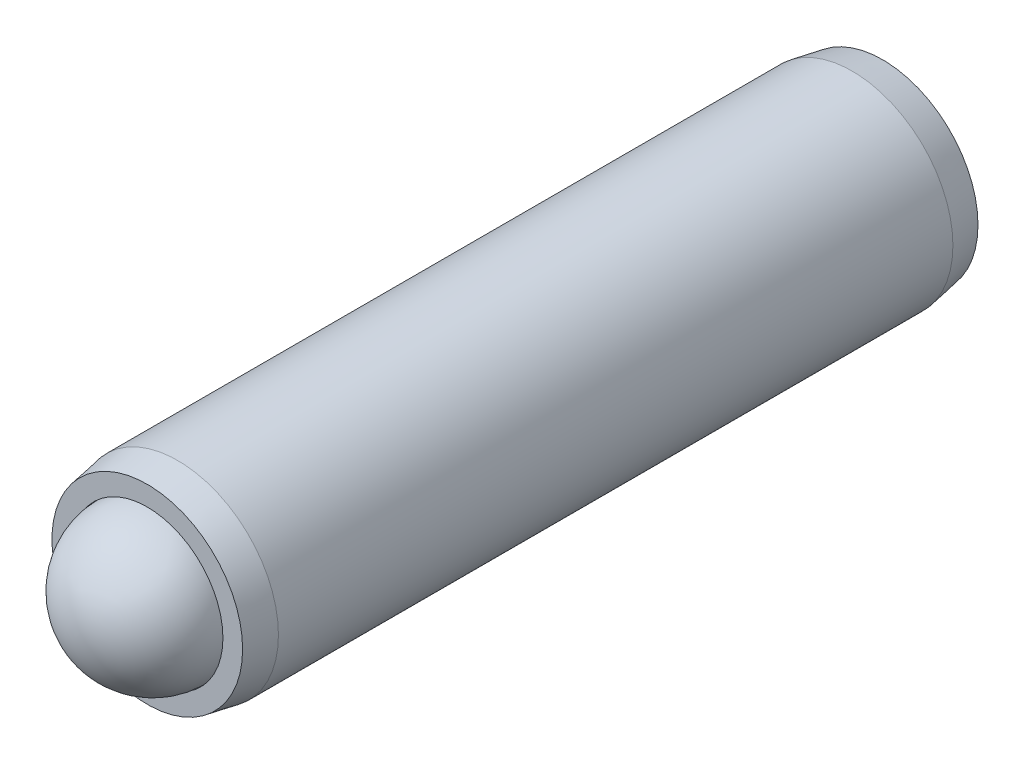
ISO-10303-21;
HEADER;
FILE_DESCRIPTION(('STEP AP214'),'2;1');
FILE_NAME('part.step','',(''),(''),'','','');
FILE_SCHEMA(('AUTOMOTIVE_DESIGN { 1 0 10303 214 1 1 1 1 }'));
ENDSEC;
DATA;
#1=APPLICATION_CONTEXT('core data for automotive mechanical design processes');
#2=APPLICATION_PROTOCOL_DEFINITION('international standard','automotive_design',2000,#1);
#3=PRODUCT_CONTEXT('',#1,'mechanical');
#4=PRODUCT('Part','Part','',(#3));
#5=PRODUCT_RELATED_PRODUCT_CATEGORY('part','',(#4));
#6=PRODUCT_DEFINITION_FORMATION('','',#4);
#7=PRODUCT_DEFINITION_CONTEXT('part definition',#1,'design');
#8=PRODUCT_DEFINITION('design','',#6,#7);
#9=PRODUCT_DEFINITION_SHAPE('','',#8);
#10=(LENGTH_UNIT() NAMED_UNIT(*) SI_UNIT(.MILLI.,.METRE.));
#11=(NAMED_UNIT(*) PLANE_ANGLE_UNIT() SI_UNIT($,.RADIAN.));
#12=(NAMED_UNIT(*) SI_UNIT($,.STERADIAN.) SOLID_ANGLE_UNIT());
#13=UNCERTAINTY_MEASURE_WITH_UNIT(LENGTH_MEASURE(1.E-05),#10,'distance_accuracy_value','');
#14=(GEOMETRIC_REPRESENTATION_CONTEXT(3) GLOBAL_UNCERTAINTY_ASSIGNED_CONTEXT((#13)) GLOBAL_UNIT_ASSIGNED_CONTEXT((#10,
#11,#12)) REPRESENTATION_CONTEXT('',''));
#15=CARTESIAN_POINT('',(0.,0.,0.));
#16=DIRECTION('',(0.,0.,1.));
#17=DIRECTION('',(1.,0.,0.));
#18=AXIS2_PLACEMENT_3D('',#15,#16,#17);
#19=CARTESIAN_POINT('',(27.4924431015506,-4.03232337640702,-29.1589490354947));
#20=DIRECTION('',(0.,0.,1.));
#21=DIRECTION('',(1.,0.,0.));
#22=AXIS2_PLACEMENT_3D('',#19,#20,#21);
#23=CONICAL_SURFACE('',#22,4.5085,0.174532925199426);
#24=CARTESIAN_POINT('',(27.4924431015506,-4.03232337640702,-27.7184434533117));
#25=DIRECTION('',(0.,0.,1.));
#26=DIRECTION('',(1.,0.,0.));
#27=AXIS2_PLACEMENT_3D('',#24,#25,#26);
#28=CIRCLE('',#27,4.7625);
#29=CARTESIAN_POINT('',(32.2549431015506,-4.03232337640702,-27.7184434533117));
#30=VERTEX_POINT('',#29);
#31=EDGE_CURVE('P0_E150',#30,#30,#28,.T.);
#32=ORIENTED_EDGE('',*,*,#31,.F.);
#33=EDGE_LOOP('',(#32));
#34=FACE_BOUND('',#33,.T.);
#35=CARTESIAN_POINT('',(27.4924431015506,-4.03232337640702,-29.1589490354947));
#36=DIRECTION('',(0.,0.,1.));
#37=DIRECTION('',(1.,0.,0.));
#38=AXIS2_PLACEMENT_3D('',#35,#36,#37);
#39=CIRCLE('',#38,4.5085);
#40=CARTESIAN_POINT('',(32.0009431015506,-4.03232337640702,-29.1589490354947));
#41=VERTEX_POINT('',#40);
#42=EDGE_CURVE('P0_E126',#41,#41,#39,.T.);
#43=ORIENTED_EDGE('',*,*,#42,.T.);
#44=EDGE_LOOP('',(#43));
#45=FACE_BOUND('',#44,.T.);
#46=ADVANCED_FACE('P0_F16',(#34,#45),#23,.T.);
#47=CARTESIAN_POINT('',(27.4924431015506,-4.03232337640702,0.317781896403881));
#48=DIRECTION('',(0.,0.,1.));
#49=DIRECTION('',(1.,0.,0.));
#50=AXIS2_PLACEMENT_3D('',#47,#48,#49);
#51=CYLINDRICAL_SURFACE('',#50,4.7625);
#52=CARTESIAN_POINT('',(27.4924431015506,-4.03232337640702,4.18267038232245));
#53=DIRECTION('',(0.,0.,1.));
#54=DIRECTION('',(1.,0.,0.));
#55=AXIS2_PLACEMENT_3D('',#52,#53,#54);
#56=CIRCLE('',#55,4.7625);
#57=CARTESIAN_POINT('',(32.2549431015506,-4.03232337640702,4.18267038232245));
#58=VERTEX_POINT('',#57);
#59=EDGE_CURVE('P0_E147',#58,#58,#56,.T.);
#60=ORIENTED_EDGE('',*,*,#59,.F.);
#61=EDGE_LOOP('',(#60));
#62=FACE_BOUND('',#61,.T.);
#63=ORIENTED_EDGE('',*,*,#31,.T.);
#64=EDGE_LOOP('',(#63));
#65=FACE_BOUND('',#64,.T.);
#66=ADVANCED_FACE('P0_F219',(#62,#65),#51,.T.);
#67=CARTESIAN_POINT('',(27.4924431015506,-4.03232337640702,4.18267038232245));
#68=DIRECTION('',(0.,0.,-1.));
#69=DIRECTION('',(-1.,0.,0.));
#70=AXIS2_PLACEMENT_3D('',#67,#68,#69);
#71=CONICAL_SURFACE('',#70,4.7625,0.174532925199434);
#72=CARTESIAN_POINT('',(27.4924431015506,-4.03232337640702,5.62317596450535));
#73=DIRECTION('',(0.,0.,1.));
#74=DIRECTION('',(1.,0.,0.));
#75=AXIS2_PLACEMENT_3D('',#72,#73,#74);
#76=CIRCLE('',#75,4.5085);
#77=CARTESIAN_POINT('',(32.0009431015506,-4.03232337640702,5.62317596450535));
#78=VERTEX_POINT('',#77);
#79=EDGE_CURVE('P0_E144',#78,#78,#76,.T.);
#80=ORIENTED_EDGE('',*,*,#79,.F.);
#81=EDGE_LOOP('',(#80));
#82=FACE_BOUND('',#81,.T.);
#83=ORIENTED_EDGE('',*,*,#59,.T.);
#84=EDGE_LOOP('',(#83));
#85=FACE_BOUND('',#84,.T.);
#86=ADVANCED_FACE('P0_F225',(#82,#85),#71,.T.);
#87=CARTESIAN_POINT('',(27.4924431015506,0.476176623592979,5.62317596450534));
#88=DIRECTION('',(0.,0.,-1.));
#89=DIRECTION('',(-1.,0.,0.));
#90=AXIS2_PLACEMENT_3D('',#87,#88,#89);
#91=PLANE('',#90);
#92=CARTESIAN_POINT('',(27.4924431015506,-4.03232337640702,5.62317596450534));
#93=DIRECTION('',(0.,0.,1.));
#94=DIRECTION('',(1.,0.,0.));
#95=AXIS2_PLACEMENT_3D('',#92,#93,#94);
#96=CIRCLE('',#95,3.578225);
#97=CARTESIAN_POINT('',(31.0706681015506,-4.03232337640702,5.62317596450534));
#98=VERTEX_POINT('',#97);
#99=EDGE_CURVE('P0_E141',#98,#98,#96,.T.);
#100=ORIENTED_EDGE('',*,*,#99,.F.);
#101=EDGE_LOOP('',(#100));
#102=FACE_BOUND('',#101,.T.);
#103=ORIENTED_EDGE('',*,*,#79,.T.);
#104=EDGE_LOOP('',(#103));
#105=FACE_BOUND('',#104,.T.);
#106=ADVANCED_FACE('P0_F362',(#102,#105),#91,.F.);
#107=CARTESIAN_POINT('',(27.4924431015506,-4.03232337640702,0.317781896403881));
#108=DIRECTION('',(0.,0.,1.));
#109=DIRECTION('',(1.,0.,0.));
#110=AXIS2_PLACEMENT_3D('',#107,#108,#109);
#111=CYLINDRICAL_SURFACE('',#110,3.578225);
#112=CARTESIAN_POINT('',(27.4924431015506,-4.03232337640702,3.89600689640397));
#113=DIRECTION('',(0.,0.,1.));
#114=DIRECTION('',(1.,0.,0.));
#115=AXIS2_PLACEMENT_3D('',#112,#113,#114);
#116=CIRCLE('',#115,3.578225);
#117=CARTESIAN_POINT('',(31.0706681015506,-4.03232337640702,3.89600689640397));
#118=VERTEX_POINT('',#117);
#119=EDGE_CURVE('P0_E138',#118,#118,#116,.T.);
#120=ORIENTED_EDGE('',*,*,#119,.F.);
#121=EDGE_LOOP('',(#120));
#122=FACE_BOUND('',#121,.T.);
#123=ORIENTED_EDGE('',*,*,#99,.T.);
#124=EDGE_LOOP('',(#123));
#125=FACE_BOUND('',#124,.T.);
#126=ADVANCED_FACE('P0_F353',(#122,#125),#111,.F.);
#127=CARTESIAN_POINT('',(27.4924431015506,-4.03232337640702,3.89600689640397));
#128=DIRECTION('',(0.,0.,1.));
#129=DIRECTION('',(1.,0.,0.));
#130=AXIS2_PLACEMENT_3D('',#127,#128,#129);
#131=CONICAL_SURFACE('',#130,3.578225,0.785398163397436);
#132=CARTESIAN_POINT('',(27.4924431015506,-4.03232337640702,0.317781896403881));
#133=VERTEX_POINT('',#132);
#134=VERTEX_LOOP('',#133);
#135=FACE_BOUND('',#134,.T.);
#136=ORIENTED_EDGE('',*,*,#119,.T.);
#137=EDGE_LOOP('',(#136));
#138=FACE_BOUND('',#137,.T.);
#139=ADVANCED_FACE('P0_F344',(#135,#138),#131,.F.);
#140=CARTESIAN_POINT('',(27.4924431015506,0.476176623592979,-29.1589490354947));
#141=DIRECTION('',(0.,0.,1.));
#142=DIRECTION('',(1.,0.,0.));
#143=AXIS2_PLACEMENT_3D('',#140,#141,#142);
#144=PLANE('',#143);
#145=DIRECTION('',(1.,0.,0.));
#146=VECTOR('',#145,1.);
#147=CARTESIAN_POINT('',(27.4924431015506,-6.66757337640702,-29.1589490354947));
#148=LINE('',#147,#146);
#149=CARTESIAN_POINT('',(25.9709808046687,-6.66757337640702,-29.1589490354947));
#150=VERTEX_POINT('',#149);
#151=CARTESIAN_POINT('',(29.0139053984326,-6.66757337640702,-29.1589490354947));
#152=VERTEX_POINT('',#151);
#153=EDGE_CURVE('P0_E164',#150,#152,#148,.T.);
#154=ORIENTED_EDGE('',*,*,#153,.T.);
#155=DIRECTION('',(0.5,0.866025403784439,0.));
#156=VECTOR('',#155,1.);
#157=CARTESIAN_POINT('',(31.7268743133546,-1.96857337640702,-29.1589490354947));
#158=LINE('',#157,#156);
#159=CARTESIAN_POINT('',(30.5353676953146,-4.03232337640702,-29.1589490354947));
#160=VERTEX_POINT('',#159);
#161=EDGE_CURVE('P0_E166',#152,#160,#158,.T.);
#162=ORIENTED_EDGE('',*,*,#161,.T.);
#163=DIRECTION('',(-0.5,0.866025403784439,0.));
#164=VECTOR('',#163,1.);
#165=CARTESIAN_POINT('',(27.8223987803925,0.666676623592978,-29.1589490354947));
#166=LINE('',#165,#164);
#167=CARTESIAN_POINT('',(29.0139053984326,-1.39707337640702,-29.1589490354947));
#168=VERTEX_POINT('',#167);
#169=EDGE_CURVE('P0_E156',#160,#168,#166,.T.);
#170=ORIENTED_EDGE('',*,*,#169,.T.);
#171=DIRECTION('',(-1.,0.,0.));
#172=VECTOR('',#171,1.);
#173=CARTESIAN_POINT('',(27.4924431015506,-1.39707337640702,-29.1589490354947));
#174=LINE('',#173,#172);
#175=CARTESIAN_POINT('',(25.9709808046687,-1.39707337640702,-29.1589490354947));
#176=VERTEX_POINT('',#175);
#177=EDGE_CURVE('P0_E158',#168,#176,#174,.T.);
#178=ORIENTED_EDGE('',*,*,#177,.T.);
#179=DIRECTION('',(-0.5,-0.866025403784438,0.));
#180=VECTOR('',#179,1.);
#181=CARTESIAN_POINT('',(27.1624874227088,0.666676623592977,-29.1589490354947));
#182=LINE('',#181,#180);
#183=CARTESIAN_POINT('',(24.4495185077867,-4.03232337640702,-29.1589490354947));
#184=VERTEX_POINT('',#183);
#185=EDGE_CURVE('P0_E160',#176,#184,#182,.T.);
#186=ORIENTED_EDGE('',*,*,#185,.T.);
#187=DIRECTION('',(0.5,-0.866025403784439,0.));
#188=VECTOR('',#187,1.);
#189=CARTESIAN_POINT('',(23.2580118897466,-1.96857337640702,-29.1589490354947));
#190=LINE('',#189,#188);
#191=EDGE_CURVE('P0_E162',#184,#150,#190,.T.);
#192=ORIENTED_EDGE('',*,*,#191,.T.);
#193=EDGE_LOOP('',(#154,#162,#170,#178,#186,#192));
#194=FACE_BOUND('',#193,.T.);
#195=ORIENTED_EDGE('',*,*,#42,.F.);
#196=EDGE_LOOP('',(#195));
#197=FACE_BOUND('',#196,.T.);
#198=ADVANCED_FACE('P0_F336',(#194,#197),#144,.F.);
#199=CARTESIAN_POINT('',(26.1176277730428,-6.41357337640702,-24.0789490354947));
#200=DIRECTION('',(-0.866025403784439,-0.5,0.));
#201=DIRECTION('',(0.5,-0.866025403784439,0.));
#202=AXIS2_PLACEMENT_3D('',#199,#200,#201);
#203=PLANE('',#202);
#204=DIRECTION('',(0.,0.,-1.));
#205=VECTOR('',#204,1.);
#206=CARTESIAN_POINT('',(26.1176277730428,-6.41357337640702,-24.0789490354947));
#207=LINE('',#206,#205);
#208=CARTESIAN_POINT('',(26.1176277730428,-6.41357337640702,-24.0789490354947));
#209=VERTEX_POINT('',#208);
#210=CARTESIAN_POINT('',(26.1176277730428,-6.41357337640702,-28.9049490354947));
#211=VERTEX_POINT('',#210);
#212=EDGE_CURVE('P0_E124',#209,#211,#207,.T.);
#213=ORIENTED_EDGE('',*,*,#212,.T.);
#214=DIRECTION('',(-0.5,0.866025403784439,0.));
#215=VECTOR('',#214,1.);
#216=CARTESIAN_POINT('',(26.1176277730428,-6.41357337640702,-28.9049490354947));
#217=LINE('',#216,#215);
#218=CARTESIAN_POINT('',(24.742812444535,-4.03232337640702,-28.9049490354947));
#219=VERTEX_POINT('',#218);
#220=EDGE_CURVE('P0_E98',#211,#219,#217,.T.);
#221=ORIENTED_EDGE('',*,*,#220,.T.);
#222=DIRECTION('',(0.,0.,-1.));
#223=VECTOR('',#222,1.);
#224=CARTESIAN_POINT('',(24.742812444535,-4.03232337640702,-24.0789490354947));
#225=LINE('',#224,#223);
#226=CARTESIAN_POINT('',(24.742812444535,-4.03232337640702,-24.0789490354947));
#227=VERTEX_POINT('',#226);
#228=EDGE_CURVE('P0_E90',#227,#219,#225,.T.);
#229=ORIENTED_EDGE('',*,*,#228,.F.);
#230=DIRECTION('',(-0.5,0.866025403784439,0.));
#231=VECTOR('',#230,1.);
#232=CARTESIAN_POINT('',(26.1176277730428,-6.41357337640702,-24.0789490354947));
#233=LINE('',#232,#231);
#234=EDGE_CURVE('P0_E95',#209,#227,#233,.T.);
#235=ORIENTED_EDGE('',*,*,#234,.F.);
#236=EDGE_LOOP('',(#213,#221,#229,#235));
#237=FACE_BOUND('',#236,.T.);
#238=ADVANCED_FACE('P0_F93',(#237),#203,.F.);
#239=CARTESIAN_POINT('',(28.8672584300584,-6.41357337640702,-24.0789490354947));
#240=DIRECTION('',(0.,-1.,0.));
#241=DIRECTION('',(1.,0.,0.));
#242=AXIS2_PLACEMENT_3D('',#239,#240,#241);
#243=PLANE('',#242);
#244=DIRECTION('',(0.,0.,-1.));
#245=VECTOR('',#244,1.);
#246=CARTESIAN_POINT('',(28.8672584300584,-6.41357337640702,-24.0789490354947));
#247=LINE('',#246,#245);
#248=CARTESIAN_POINT('',(28.8672584300584,-6.41357337640702,-24.0789490354947));
#249=VERTEX_POINT('',#248);
#250=CARTESIAN_POINT('',(28.8672584300584,-6.41357337640702,-28.9049490354947));
#251=VERTEX_POINT('',#250);
#252=EDGE_CURVE('P0_E127',#249,#251,#247,.T.);
#253=ORIENTED_EDGE('',*,*,#252,.T.);
#254=DIRECTION('',(-1.,0.,0.));
#255=VECTOR('',#254,1.);
#256=CARTESIAN_POINT('',(28.8672584300584,-6.41357337640702,-28.9049490354947));
#257=LINE('',#256,#255);
#258=EDGE_CURVE('P0_E169',#251,#211,#257,.T.);
#259=ORIENTED_EDGE('',*,*,#258,.T.);
#260=ORIENTED_EDGE('',*,*,#212,.F.);
#261=DIRECTION('',(-1.,0.,0.));
#262=VECTOR('',#261,1.);
#263=CARTESIAN_POINT('',(28.8672584300584,-6.41357337640702,-24.0789490354947));
#264=LINE('',#263,#262);
#265=EDGE_CURVE('P0_E100',#249,#209,#264,.T.);
#266=ORIENTED_EDGE('',*,*,#265,.F.);
#267=EDGE_LOOP('',(#253,#259,#260,#266));
#268=FACE_BOUND('',#267,.T.);
#269=ADVANCED_FACE('P0_F254',(#268),#243,.F.);
#270=CARTESIAN_POINT('',(30.2420737585662,-4.03232337640702,-24.0789490354947));
#271=DIRECTION('',(0.866025403784438,-0.5,0.));
#272=DIRECTION('',(0.5,0.866025403784438,0.));
#273=AXIS2_PLACEMENT_3D('',#270,#271,#272);
#274=PLANE('',#273);
#275=DIRECTION('',(0.,0.,-1.));
#276=VECTOR('',#275,1.);
#277=CARTESIAN_POINT('',(30.2420737585662,-4.03232337640702,-24.0789490354947));
#278=LINE('',#277,#276);
#279=CARTESIAN_POINT('',(30.2420737585662,-4.03232337640702,-24.0789490354947));
#280=VERTEX_POINT('',#279);
#281=CARTESIAN_POINT('',(30.2420737585662,-4.03232337640702,-28.9049490354947));
#282=VERTEX_POINT('',#281);
#283=EDGE_CURVE('P0_E130',#280,#282,#278,.T.);
#284=ORIENTED_EDGE('',*,*,#283,.T.);
#285=DIRECTION('',(-0.5,-0.866025403784438,0.));
#286=VECTOR('',#285,1.);
#287=CARTESIAN_POINT('',(30.2420737585662,-4.03232337640702,-28.9049490354947));
#288=LINE('',#287,#286);
#289=EDGE_CURVE('P0_E153',#282,#251,#288,.T.);
#290=ORIENTED_EDGE('',*,*,#289,.T.);
#291=ORIENTED_EDGE('',*,*,#252,.F.);
#292=DIRECTION('',(-0.5,-0.866025403784438,0.));
#293=VECTOR('',#292,1.);
#294=CARTESIAN_POINT('',(30.2420737585662,-4.03232337640702,-24.0789490354947));
#295=LINE('',#294,#293);
#296=EDGE_CURVE('P0_E121',#280,#249,#295,.T.);
#297=ORIENTED_EDGE('',*,*,#296,.F.);
#298=EDGE_LOOP('',(#284,#290,#291,#297));
#299=FACE_BOUND('',#298,.T.);
#300=ADVANCED_FACE('P0_F207',(#299),#274,.F.);
#301=CARTESIAN_POINT('',(28.8672584300584,-1.65107337640702,-24.0789490354947));
#302=DIRECTION('',(0.866025403784438,0.5,0.));
#303=DIRECTION('',(-0.5,0.866025403784439,0.));
#304=AXIS2_PLACEMENT_3D('',#301,#302,#303);
#305=PLANE('',#304);
#306=DIRECTION('',(0.,0.,-1.));
#307=VECTOR('',#306,1.);
#308=CARTESIAN_POINT('',(28.8672584300584,-1.65107337640702,-24.0789490354947));
#309=LINE('',#308,#307);
#310=CARTESIAN_POINT('',(28.8672584300584,-1.65107337640702,-24.0789490354947));
#311=VERTEX_POINT('',#310);
#312=CARTESIAN_POINT('',(28.8672584300584,-1.65107337640702,-28.9049490354947));
#313=VERTEX_POINT('',#312);
#314=EDGE_CURVE('P0_E133',#311,#313,#309,.T.);
#315=ORIENTED_EDGE('',*,*,#314,.T.);
#316=DIRECTION('',(0.5,-0.866025403784439,0.));
#317=VECTOR('',#316,1.);
#318=CARTESIAN_POINT('',(28.8672584300584,-1.65107337640702,-28.9049490354947));
#319=LINE('',#318,#317);
#320=EDGE_CURVE('P0_E11',#313,#282,#319,.T.);
#321=ORIENTED_EDGE('',*,*,#320,.T.);
#322=ORIENTED_EDGE('',*,*,#283,.F.);
#323=DIRECTION('',(0.5,-0.866025403784439,0.));
#324=VECTOR('',#323,1.);
#325=CARTESIAN_POINT('',(28.8672584300584,-1.65107337640702,-24.0789490354947));
#326=LINE('',#325,#324);
#327=EDGE_CURVE('P0_E118',#311,#280,#326,.T.);
#328=ORIENTED_EDGE('',*,*,#327,.F.);
#329=EDGE_LOOP('',(#315,#321,#322,#328));
#330=FACE_BOUND('',#329,.T.);
#331=ADVANCED_FACE('P0_F203',(#330),#305,.F.);
#332=CARTESIAN_POINT('',(26.1176277730428,-1.65107337640702,-24.0789490354947));
#333=DIRECTION('',(0.,1.,0.));
#334=DIRECTION('',(0.,0.,1.));
#335=AXIS2_PLACEMENT_3D('',#332,#333,#334);
#336=PLANE('',#335);
#337=DIRECTION('',(0.,0.,-1.));
#338=VECTOR('',#337,1.);
#339=CARTESIAN_POINT('',(26.1176277730428,-1.65107337640702,-24.0789490354947));
#340=LINE('',#339,#338);
#341=CARTESIAN_POINT('',(26.1176277730428,-1.65107337640702,-24.0789490354947));
#342=VERTEX_POINT('',#341);
#343=CARTESIAN_POINT('',(26.1176277730428,-1.65107337640702,-28.9049490354947));
#344=VERTEX_POINT('',#343);
#345=EDGE_CURVE('P0_E99',#342,#344,#340,.T.);
#346=ORIENTED_EDGE('',*,*,#345,.T.);
#347=DIRECTION('',(1.,0.,0.));
#348=VECTOR('',#347,1.);
#349=CARTESIAN_POINT('',(26.1176277730428,-1.65107337640702,-28.9049490354947));
#350=LINE('',#349,#348);
#351=EDGE_CURVE('P0_E25',#344,#313,#350,.T.);
#352=ORIENTED_EDGE('',*,*,#351,.T.);
#353=ORIENTED_EDGE('',*,*,#314,.F.);
#354=DIRECTION('',(1.,0.,0.));
#355=VECTOR('',#354,1.);
#356=CARTESIAN_POINT('',(26.1176277730428,-1.65107337640702,-24.0789490354947));
#357=LINE('',#356,#355);
#358=EDGE_CURVE('P0_E108',#342,#311,#357,.T.);
#359=ORIENTED_EDGE('',*,*,#358,.F.);
#360=EDGE_LOOP('',(#346,#352,#353,#359));
#361=FACE_BOUND('',#360,.T.);
#362=ADVANCED_FACE('P0_F208',(#361),#336,.F.);
#363=CARTESIAN_POINT('',(24.742812444535,-4.03232337640702,-24.0789490354947));
#364=DIRECTION('',(-0.866025403784438,0.5,0.));
#365=DIRECTION('',(-0.5,-0.866025403784438,0.));
#366=AXIS2_PLACEMENT_3D('',#363,#364,#365);
#367=PLANE('',#366);
#368=ORIENTED_EDGE('',*,*,#228,.T.);
#369=DIRECTION('',(0.5,0.866025403784438,0.));
#370=VECTOR('',#369,1.);
#371=CARTESIAN_POINT('',(24.742812444535,-4.03232337640702,-28.9049490354947));
#372=LINE('',#371,#370);
#373=EDGE_CURVE('P0_E40',#219,#344,#372,.T.);
#374=ORIENTED_EDGE('',*,*,#373,.T.);
#375=ORIENTED_EDGE('',*,*,#345,.F.);
#376=DIRECTION('',(0.5,0.866025403784438,0.));
#377=VECTOR('',#376,1.);
#378=CARTESIAN_POINT('',(24.742812444535,-4.03232337640702,-24.0789490354947));
#379=LINE('',#378,#377);
#380=EDGE_CURVE('P0_E103',#227,#342,#379,.T.);
#381=ORIENTED_EDGE('',*,*,#380,.F.);
#382=EDGE_LOOP('',(#368,#374,#375,#381));
#383=FACE_BOUND('',#382,.T.);
#384=ADVANCED_FACE('P0_F104',(#383),#367,.F.);
#385=CARTESIAN_POINT('',(27.4924431015506,-4.03232337640702,-24.0789490354947));
#386=DIRECTION('',(0.,0.,-1.));
#387=DIRECTION('',(0.,1.,0.));
#388=AXIS2_PLACEMENT_3D('',#385,#386,#387);
#389=PLANE('',#388);
#390=ORIENTED_EDGE('',*,*,#234,.T.);
#391=ORIENTED_EDGE('',*,*,#380,.T.);
#392=ORIENTED_EDGE('',*,*,#358,.T.);
#393=ORIENTED_EDGE('',*,*,#327,.T.);
#394=ORIENTED_EDGE('',*,*,#296,.T.);
#395=ORIENTED_EDGE('',*,*,#265,.T.);
#396=EDGE_LOOP('',(#390,#391,#392,#393,#394,#395));
#397=FACE_BOUND('',#396,.T.);
#398=ADVANCED_FACE('P0_F110',(#397),#389,.T.);
#399=CARTESIAN_POINT('',(24.742812444535,-4.03232337640702,-28.9049490354947));
#400=DIRECTION('',(-0.612372435695794,0.353553390593274,0.707106781186548));
#401=DIRECTION('',(0.5,0.866025403784438,0.));
#402=AXIS2_PLACEMENT_3D('',#399,#400,#401);
#403=PLANE('',#402);
#404=DIRECTION('',(-0.755928946018455,0.,-0.654653670707976));
#405=VECTOR('',#404,1.);
#406=CARTESIAN_POINT('',(25.5284212036824,-4.03232337640702,-28.2245918926375));
#407=LINE('',#406,#405);
#408=EDGE_CURVE('P0_E115',#184,#219,#407,.F.);
#409=ORIENTED_EDGE('',*,*,#408,.F.);
#410=ORIENTED_EDGE('',*,*,#185,.F.);
#411=DIRECTION('',(-0.377964473009228,0.654653670707977,-0.654653670707977));
#412=VECTOR('',#411,1.);
#413=CARTESIAN_POINT('',(26.5104321526165,-2.33143051926416,-28.2245918926375));
#414=LINE('',#413,#412);
#415=EDGE_CURVE('P0_E20',#344,#176,#414,.T.);
#416=ORIENTED_EDGE('',*,*,#415,.F.);
#417=ORIENTED_EDGE('',*,*,#373,.F.);
#418=EDGE_LOOP('',(#409,#410,#416,#417));
#419=FACE_BOUND('',#418,.T.);
#420=ADVANCED_FACE('P0_F18',(#419),#403,.F.);
#421=CARTESIAN_POINT('',(26.1176277730428,-1.65107337640702,-28.9049490354947));
#422=DIRECTION('',(0.,0.707106781186548,0.707106781186548));
#423=DIRECTION('',(1.,0.,0.));
#424=AXIS2_PLACEMENT_3D('',#421,#422,#423);
#425=PLANE('',#424);
#426=ORIENTED_EDGE('',*,*,#415,.T.);
#427=ORIENTED_EDGE('',*,*,#177,.F.);
#428=DIRECTION('',(0.377964473009227,0.654653670707977,-0.654653670707977));
#429=VECTOR('',#428,1.);
#430=CARTESIAN_POINT('',(28.4744540504848,-2.33143051926416,-28.2245918926375));
#431=LINE('',#430,#429);
#432=EDGE_CURVE('P0_E181',#313,#168,#431,.T.);
#433=ORIENTED_EDGE('',*,*,#432,.F.);
#434=ORIENTED_EDGE('',*,*,#351,.F.);
#435=EDGE_LOOP('',(#426,#427,#433,#434));
#436=FACE_BOUND('',#435,.T.);
#437=ADVANCED_FACE('P0_F195',(#436),#425,.F.);
#438=CARTESIAN_POINT('',(26.1176277730428,-6.41357337640702,-28.9049490354947));
#439=DIRECTION('',(-0.612372435695794,-0.353553390593274,0.707106781186548));
#440=DIRECTION('',(-0.5,0.866025403784439,0.));
#441=AXIS2_PLACEMENT_3D('',#438,#439,#440);
#442=PLANE('',#441);
#443=ORIENTED_EDGE('',*,*,#408,.T.);
#444=ORIENTED_EDGE('',*,*,#220,.F.);
#445=DIRECTION('',(-0.377964473009229,-0.654653670707977,-0.654653670707977));
#446=VECTOR('',#445,1.);
#447=CARTESIAN_POINT('',(26.5104321526165,-5.73321623354988,-28.2245918926375));
#448=LINE('',#447,#446);
#449=EDGE_CURVE('P0_E178',#150,#211,#448,.F.);
#450=ORIENTED_EDGE('',*,*,#449,.F.);
#451=ORIENTED_EDGE('',*,*,#191,.F.);
#452=EDGE_LOOP('',(#443,#444,#450,#451));
#453=FACE_BOUND('',#452,.T.);
#454=ADVANCED_FACE('P0_F187',(#453),#442,.F.);
#455=CARTESIAN_POINT('',(28.8672584300584,-1.65107337640702,-28.9049490354947));
#456=DIRECTION('',(0.612372435695794,0.353553390593274,0.707106781186547));
#457=DIRECTION('',(0.5,-0.866025403784439,0.));
#458=AXIS2_PLACEMENT_3D('',#455,#456,#457);
#459=PLANE('',#458);
#460=ORIENTED_EDGE('',*,*,#432,.T.);
#461=ORIENTED_EDGE('',*,*,#169,.F.);
#462=DIRECTION('',(-0.755928946018456,0.,0.654653670707976));
#463=VECTOR('',#462,1.);
#464=CARTESIAN_POINT('',(30.2420737585662,-4.03232337640702,-28.9049490354947));
#465=LINE('',#464,#463);
#466=EDGE_CURVE('P0_E176',#282,#160,#465,.F.);
#467=ORIENTED_EDGE('',*,*,#466,.F.);
#468=ORIENTED_EDGE('',*,*,#320,.F.);
#469=EDGE_LOOP('',(#460,#461,#467,#468));
#470=FACE_BOUND('',#469,.T.);
#471=ADVANCED_FACE('P0_F200',(#470),#459,.F.);
#472=CARTESIAN_POINT('',(28.8672584300584,-6.41357337640702,-28.9049490354947));
#473=DIRECTION('',(0.,-0.707106781186548,0.707106781186547));
#474=DIRECTION('',(-1.,0.,0.));
#475=AXIS2_PLACEMENT_3D('',#472,#473,#474);
#476=PLANE('',#475);
#477=ORIENTED_EDGE('',*,*,#449,.T.);
#478=ORIENTED_EDGE('',*,*,#258,.F.);
#479=DIRECTION('',(0.377964473009232,-0.654653670707975,-0.654653670707976));
#480=VECTOR('',#479,1.);
#481=CARTESIAN_POINT('',(28.4744540504848,-5.73321623354989,-28.2245918926375));
#482=LINE('',#481,#480);
#483=EDGE_CURVE('P0_E174',#152,#251,#482,.F.);
#484=ORIENTED_EDGE('',*,*,#483,.F.);
#485=ORIENTED_EDGE('',*,*,#153,.F.);
#486=EDGE_LOOP('',(#477,#478,#484,#485));
#487=FACE_BOUND('',#486,.T.);
#488=ADVANCED_FACE('P0_F235',(#487),#476,.F.);
#489=CARTESIAN_POINT('',(30.2420737585662,-4.03232337640702,-28.9049490354947));
#490=DIRECTION('',(0.612372435695792,-0.353553390593273,0.70710678118655));
#491=DIRECTION('',(-0.5,-0.866025403784438,0.));
#492=AXIS2_PLACEMENT_3D('',#489,#490,#491);
#493=PLANE('',#492);
#494=ORIENTED_EDGE('',*,*,#466,.T.);
#495=ORIENTED_EDGE('',*,*,#161,.F.);
#496=ORIENTED_EDGE('',*,*,#483,.T.);
#497=ORIENTED_EDGE('',*,*,#289,.F.);
#498=EDGE_LOOP('',(#494,#495,#496,#497));
#499=FACE_BOUND('',#498,.T.);
#500=ADVANCED_FACE('P0_F232',(#499),#493,.F.);
#501=CLOSED_SHELL('',(#46,#66,#86,#106,#126,#139,#198,#238,#269,#300,#331,#362,#384,#398,#420,
#437,#454,#471,#488,#500));
#502=MANIFOLD_SOLID_BREP('P0_B1',#501);
#503=CARTESIAN_POINT('',(27.4924431015506,-4.03232337640701,5.36917596450534));
#504=DIRECTION('',(0.205203952862159,-0.14775125513884,0.96750240533791));
#505=DIRECTION('',(0.755586140468623,0.652235352440939,-0.0606517053179379));
#506=AXIS2_PLACEMENT_3D('',#503,#504,#505);
#507=SPHERICAL_SURFACE('',#506,3.571875);
#508=CARTESIAN_POINT('',(28.2254059706802,-4.56007239085606,8.82497361857169));
#509=VERTEX_POINT('',#508);
#510=VERTEX_LOOP('',#509);
#511=FACE_BOUND('',#510,.T.);
#512=ADVANCED_FACE('P1_F11',(#511),#507,.T.);
#513=CLOSED_SHELL('',(#512));
#514=MANIFOLD_SOLID_BREP('P1_B1',#513);
#515=ADVANCED_BREP_SHAPE_REPRESENTATION('',(#18,#502,#514),#14);
#516=SHAPE_DEFINITION_REPRESENTATION(#9,#515);
ENDSEC;
END-ISO-10303-21;
